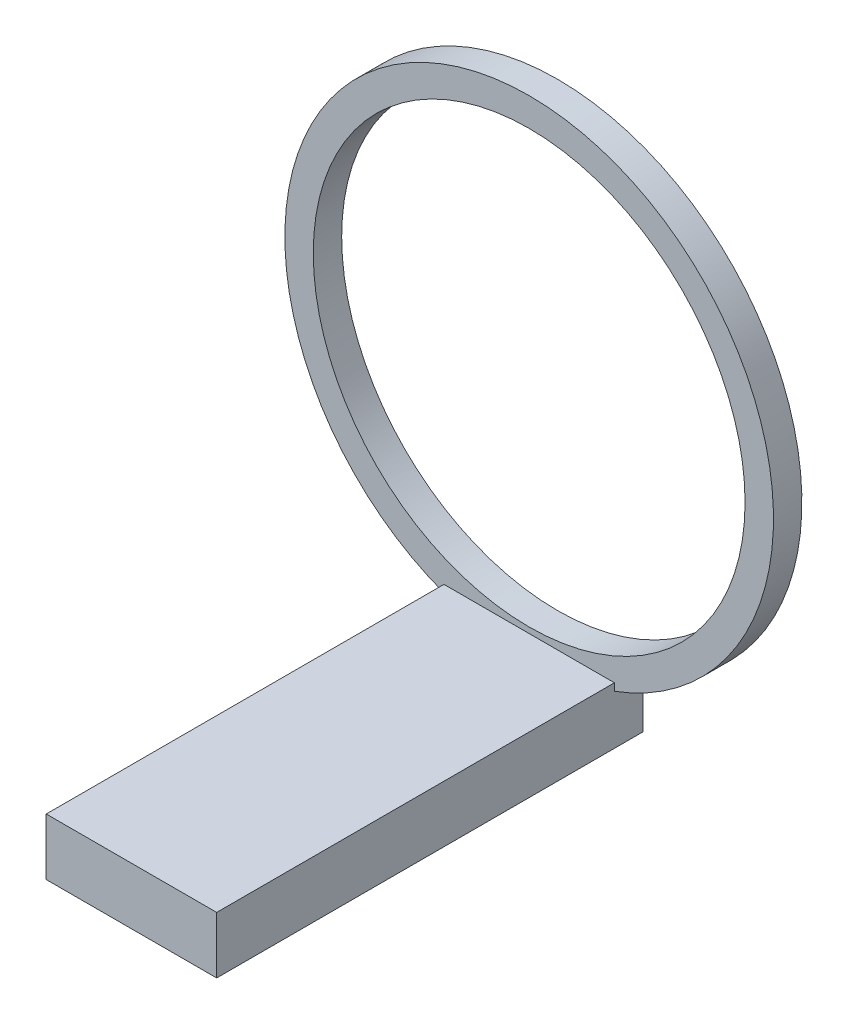
ISO-10303-21;
HEADER;
FILE_DESCRIPTION(('STEP AP214'),'2;1');
FILE_NAME('part.step','',(''),(''),'','','');
FILE_SCHEMA(('AUTOMOTIVE_DESIGN { 1 0 10303 214 1 1 1 1 }'));
ENDSEC;
DATA;
#1=APPLICATION_CONTEXT('core data for automotive mechanical design processes');
#2=APPLICATION_PROTOCOL_DEFINITION('international standard','automotive_design',2000,#1);
#3=PRODUCT_CONTEXT('',#1,'mechanical');
#4=PRODUCT('Part','Part','',(#3));
#5=PRODUCT_RELATED_PRODUCT_CATEGORY('part','',(#4));
#6=PRODUCT_DEFINITION_FORMATION('','',#4);
#7=PRODUCT_DEFINITION_CONTEXT('part definition',#1,'design');
#8=PRODUCT_DEFINITION('design','',#6,#7);
#9=PRODUCT_DEFINITION_SHAPE('','',#8);
#10=(LENGTH_UNIT() NAMED_UNIT(*) SI_UNIT(.MILLI.,.METRE.));
#11=(NAMED_UNIT(*) PLANE_ANGLE_UNIT() SI_UNIT($,.RADIAN.));
#12=(NAMED_UNIT(*) SI_UNIT($,.STERADIAN.) SOLID_ANGLE_UNIT());
#13=UNCERTAINTY_MEASURE_WITH_UNIT(LENGTH_MEASURE(1.E-05),#10,'distance_accuracy_value','');
#14=(GEOMETRIC_REPRESENTATION_CONTEXT(3) GLOBAL_UNCERTAINTY_ASSIGNED_CONTEXT((#13)) GLOBAL_UNIT_ASSIGNED_CONTEXT((#10,
#11,#12)) REPRESENTATION_CONTEXT('',''));
#15=CARTESIAN_POINT('',(0.,0.,0.));
#16=DIRECTION('',(0.,0.,1.));
#17=DIRECTION('',(1.,0.,0.));
#18=AXIS2_PLACEMENT_3D('',#15,#16,#17);
#19=CARTESIAN_POINT('',(-19.05,0.,95.25));
#20=DIRECTION('',(0.,-1.,0.));
#21=DIRECTION('',(1.,0.,0.));
#22=AXIS2_PLACEMENT_3D('',#19,#20,#21);
#23=PLANE('',#22);
#24=DIRECTION('',(1.,0.,0.));
#25=VECTOR('',#24,1.);
#26=CARTESIAN_POINT('',(-19.05,0.,6.34999999999999));
#27=LINE('',#26,#25);
#28=CARTESIAN_POINT('',(-19.05,0.,6.34999999999999));
#29=VERTEX_POINT('',#28);
#30=CARTESIAN_POINT('',(19.05,0.,6.34999999999999));
#31=VERTEX_POINT('',#30);
#32=EDGE_CURVE('E130',#29,#31,#27,.T.);
#33=ORIENTED_EDGE('',*,*,#32,.F.);
#34=DIRECTION('',(0.,0.,-1.));
#35=VECTOR('',#34,1.);
#36=CARTESIAN_POINT('',(-19.05,0.,95.25));
#37=LINE('',#36,#35);
#38=CARTESIAN_POINT('',(-19.05,0.,95.25));
#39=VERTEX_POINT('',#38);
#40=EDGE_CURVE('E148',#39,#29,#37,.T.);
#41=ORIENTED_EDGE('',*,*,#40,.F.);
#42=DIRECTION('',(-1.,0.,0.));
#43=VECTOR('',#42,1.);
#44=CARTESIAN_POINT('',(-19.05,0.,95.25));
#45=LINE('',#44,#43);
#46=CARTESIAN_POINT('',(19.05,0.,95.25));
#47=VERTEX_POINT('',#46);
#48=EDGE_CURVE('E140',#47,#39,#45,.T.);
#49=ORIENTED_EDGE('',*,*,#48,.F.);
#50=DIRECTION('',(0.,0.,-1.));
#51=VECTOR('',#50,1.);
#52=CARTESIAN_POINT('',(19.05,0.,95.25));
#53=LINE('',#52,#51);
#54=EDGE_CURVE('E151',#47,#31,#53,.T.);
#55=ORIENTED_EDGE('',*,*,#54,.T.);
#56=EDGE_LOOP('',(#33,#41,#49,#55));
#57=FACE_BOUND('',#56,.T.);
#58=ADVANCED_FACE('F39',(#57),#23,.F.);
#59=CARTESIAN_POINT('',(-19.05,-12.7,95.25));
#60=DIRECTION('',(0.,1.,0.));
#61=DIRECTION('',(0.,0.,1.));
#62=AXIS2_PLACEMENT_3D('',#59,#60,#61);
#63=PLANE('',#62);
#64=DIRECTION('',(1.,0.,0.));
#65=VECTOR('',#64,1.);
#66=CARTESIAN_POINT('',(-19.05,-12.7,0.));
#67=LINE('',#66,#65);
#68=CARTESIAN_POINT('',(-19.05,-12.7,0.));
#69=VERTEX_POINT('',#68);
#70=CARTESIAN_POINT('',(19.05,-12.7,0.));
#71=VERTEX_POINT('',#70);
#72=EDGE_CURVE('E100',#69,#71,#67,.T.);
#73=ORIENTED_EDGE('',*,*,#72,.T.);
#74=DIRECTION('',(0.,0.,-1.));
#75=VECTOR('',#74,1.);
#76=CARTESIAN_POINT('',(19.05,-12.7,95.25));
#77=LINE('',#76,#75);
#78=CARTESIAN_POINT('',(19.05,-12.7,95.25));
#79=VERTEX_POINT('',#78);
#80=EDGE_CURVE('E47',#79,#71,#77,.T.);
#81=ORIENTED_EDGE('',*,*,#80,.F.);
#82=DIRECTION('',(1.,0.,0.));
#83=VECTOR('',#82,1.);
#84=CARTESIAN_POINT('',(-19.05,-12.7,95.25));
#85=LINE('',#84,#83);
#86=CARTESIAN_POINT('',(-19.05,-12.7,95.25));
#87=VERTEX_POINT('',#86);
#88=EDGE_CURVE('E104',#87,#79,#85,.T.);
#89=ORIENTED_EDGE('',*,*,#88,.F.);
#90=DIRECTION('',(0.,0.,-1.));
#91=VECTOR('',#90,1.);
#92=CARTESIAN_POINT('',(-19.05,-12.7,95.25));
#93=LINE('',#92,#91);
#94=EDGE_CURVE('E144',#87,#69,#93,.T.);
#95=ORIENTED_EDGE('',*,*,#94,.T.);
#96=EDGE_LOOP('',(#73,#81,#89,#95));
#97=FACE_BOUND('',#96,.T.);
#98=ADVANCED_FACE('F41',(#97),#63,.F.);
#99=CARTESIAN_POINT('',(19.05,-12.7,95.25));
#100=DIRECTION('',(-1.,0.,0.));
#101=DIRECTION('',(0.,0.,1.));
#102=AXIS2_PLACEMENT_3D('',#99,#100,#101);
#103=PLANE('',#102);
#104=DIRECTION('',(0.,1.,0.));
#105=VECTOR('',#104,1.);
#106=CARTESIAN_POINT('',(19.05,-12.7,0.));
#107=LINE('',#106,#105);
#108=CARTESIAN_POINT('',(19.05,-1.64958186620911,0.));
#109=VERTEX_POINT('',#108);
#110=EDGE_CURVE('E105',#71,#109,#107,.T.);
#111=ORIENTED_EDGE('',*,*,#110,.T.);
#112=DIRECTION('',(0.,0.,-1.));
#113=VECTOR('',#112,1.);
#114=CARTESIAN_POINT('',(19.05,-1.64958186620911,6.35));
#115=LINE('',#114,#113);
#116=CARTESIAN_POINT('',(19.05,-1.64958186620911,6.35));
#117=VERTEX_POINT('',#116);
#118=EDGE_CURVE('E56',#109,#117,#115,.F.);
#119=ORIENTED_EDGE('',*,*,#118,.T.);
#120=DIRECTION('',(0.,-1.,0.));
#121=VECTOR('',#120,1.);
#122=CARTESIAN_POINT('',(19.05,-12.7,6.34999999999999));
#123=LINE('',#122,#121);
#124=EDGE_CURVE('E60',#31,#117,#123,.T.);
#125=ORIENTED_EDGE('',*,*,#124,.F.);
#126=ORIENTED_EDGE('',*,*,#54,.F.);
#127=DIRECTION('',(0.,1.,0.));
#128=VECTOR('',#127,1.);
#129=CARTESIAN_POINT('',(19.05,-12.7,95.25));
#130=LINE('',#129,#128);
#131=EDGE_CURVE('E138',#79,#47,#130,.T.);
#132=ORIENTED_EDGE('',*,*,#131,.F.);
#133=ORIENTED_EDGE('',*,*,#80,.T.);
#134=EDGE_LOOP('',(#111,#119,#125,#126,#132,#133));
#135=FACE_BOUND('',#134,.T.);
#136=ADVANCED_FACE('F155',(#135),#103,.F.);
#137=CARTESIAN_POINT('',(-19.05,-12.7,95.25));
#138=DIRECTION('',(1.,0.,0.));
#139=DIRECTION('',(0.,0.,-1.));
#140=AXIS2_PLACEMENT_3D('',#137,#138,#139);
#141=PLANE('',#140);
#142=DIRECTION('',(0.,1.,0.));
#143=VECTOR('',#142,1.);
#144=CARTESIAN_POINT('',(-19.05,-12.7,6.34999999999999));
#145=LINE('',#144,#143);
#146=CARTESIAN_POINT('',(-19.05,-1.64958186620911,6.35));
#147=VERTEX_POINT('',#146);
#148=EDGE_CURVE('E11',#147,#29,#145,.T.);
#149=ORIENTED_EDGE('',*,*,#148,.F.);
#150=DIRECTION('',(0.,0.,-1.));
#151=VECTOR('',#150,1.);
#152=CARTESIAN_POINT('',(-19.05,-1.64958186620911,6.35));
#153=LINE('',#152,#151);
#154=CARTESIAN_POINT('',(-19.05,-1.64958186620912,0.));
#155=VERTEX_POINT('',#154);
#156=EDGE_CURVE('E108',#147,#155,#153,.T.);
#157=ORIENTED_EDGE('',*,*,#156,.T.);
#158=DIRECTION('',(0.,-1.,0.));
#159=VECTOR('',#158,1.);
#160=CARTESIAN_POINT('',(-19.05,-12.7,0.));
#161=LINE('',#160,#159);
#162=EDGE_CURVE('E93',#155,#69,#161,.T.);
#163=ORIENTED_EDGE('',*,*,#162,.T.);
#164=ORIENTED_EDGE('',*,*,#94,.F.);
#165=DIRECTION('',(0.,-1.,0.));
#166=VECTOR('',#165,1.);
#167=CARTESIAN_POINT('',(-19.05,-12.7,95.25));
#168=LINE('',#167,#166);
#169=EDGE_CURVE('E142',#39,#87,#168,.T.);
#170=ORIENTED_EDGE('',*,*,#169,.F.);
#171=ORIENTED_EDGE('',*,*,#40,.T.);
#172=EDGE_LOOP('',(#149,#157,#163,#164,#170,#171));
#173=FACE_BOUND('',#172,.T.);
#174=ADVANCED_FACE('F109',(#173),#141,.F.);
#175=CARTESIAN_POINT('',(0.,0.,95.25));
#176=DIRECTION('',(0.,0.,1.));
#177=DIRECTION('',(1.,0.,0.));
#178=AXIS2_PLACEMENT_3D('',#175,#176,#177);
#179=PLANE('',#178);
#180=ORIENTED_EDGE('',*,*,#88,.T.);
#181=ORIENTED_EDGE('',*,*,#131,.T.);
#182=ORIENTED_EDGE('',*,*,#48,.T.);
#183=ORIENTED_EDGE('',*,*,#169,.T.);
#184=EDGE_LOOP('',(#180,#181,#182,#183));
#185=FACE_BOUND('',#184,.T.);
#186=ADVANCED_FACE('F161',(#185),#179,.T.);
#187=CARTESIAN_POINT('',(0.,0.,0.));
#188=DIRECTION('',(0.,0.,1.));
#189=DIRECTION('',(1.,0.,0.));
#190=AXIS2_PLACEMENT_3D('',#187,#188,#189);
#191=PLANE('',#190);
#192=ORIENTED_EDGE('',*,*,#162,.F.);
#193=CARTESIAN_POINT('',(0.,49.53,0.));
#194=DIRECTION('',(0.,0.,-1.));
#195=DIRECTION('',(-1.,0.,0.));
#196=AXIS2_PLACEMENT_3D('',#193,#194,#195);
#197=CIRCLE('',#196,54.61);
#198=EDGE_CURVE('E98',#155,#109,#197,.T.);
#199=ORIENTED_EDGE('',*,*,#198,.T.);
#200=ORIENTED_EDGE('',*,*,#110,.F.);
#201=ORIENTED_EDGE('',*,*,#72,.F.);
#202=EDGE_LOOP('',(#192,#199,#200,#201));
#203=FACE_BOUND('',#202,.T.);
#204=CARTESIAN_POINT('',(0.,49.53,0.));
#205=DIRECTION('',(0.,0.,-1.));
#206=DIRECTION('',(-1.,0.,0.));
#207=AXIS2_PLACEMENT_3D('',#204,#205,#206);
#208=CIRCLE('',#207,48.26);
#209=CARTESIAN_POINT('',(-48.26,49.53,0.));
#210=VERTEX_POINT('',#209);
#211=EDGE_CURVE('E124',#210,#210,#208,.T.);
#212=ORIENTED_EDGE('',*,*,#211,.F.);
#213=EDGE_LOOP('',(#212));
#214=FACE_BOUND('',#213,.T.);
#215=ADVANCED_FACE('F95',(#203,#214),#191,.F.);
#216=CARTESIAN_POINT('',(0.,49.53,6.35));
#217=DIRECTION('',(0.,0.,-1.));
#218=DIRECTION('',(-1.,0.,0.));
#219=AXIS2_PLACEMENT_3D('',#216,#217,#218);
#220=PLANE('',#219);
#221=CARTESIAN_POINT('',(0.,49.53,6.35));
#222=DIRECTION('',(0.,0.,-1.));
#223=DIRECTION('',(-1.,0.,0.));
#224=AXIS2_PLACEMENT_3D('',#221,#222,#223);
#225=CIRCLE('',#224,48.26);
#226=CARTESIAN_POINT('',(-48.26,49.53,6.35));
#227=VERTEX_POINT('',#226);
#228=EDGE_CURVE('E118',#227,#227,#225,.T.);
#229=ORIENTED_EDGE('',*,*,#228,.T.);
#230=EDGE_LOOP('',(#229));
#231=FACE_BOUND('',#230,.T.);
#232=ORIENTED_EDGE('',*,*,#32,.T.);
#233=ORIENTED_EDGE('',*,*,#124,.T.);
#234=CARTESIAN_POINT('',(0.,49.53,6.35));
#235=DIRECTION('',(0.,0.,-1.));
#236=DIRECTION('',(-1.,0.,0.));
#237=AXIS2_PLACEMENT_3D('',#234,#235,#236);
#238=CIRCLE('',#237,54.61);
#239=EDGE_CURVE('E114',#147,#117,#238,.T.);
#240=ORIENTED_EDGE('',*,*,#239,.F.);
#241=ORIENTED_EDGE('',*,*,#148,.T.);
#242=EDGE_LOOP('',(#232,#233,#240,#241));
#243=FACE_BOUND('',#242,.T.);
#244=ADVANCED_FACE('F165',(#231,#243),#220,.F.);
#245=CARTESIAN_POINT('',(0.,49.53,6.35));
#246=DIRECTION('',(0.,0.,-1.));
#247=DIRECTION('',(-1.,0.,0.));
#248=AXIS2_PLACEMENT_3D('',#245,#246,#247);
#249=CYLINDRICAL_SURFACE('',#248,54.61);
#250=ORIENTED_EDGE('',*,*,#118,.F.);
#251=ORIENTED_EDGE('',*,*,#198,.F.);
#252=ORIENTED_EDGE('',*,*,#156,.F.);
#253=ORIENTED_EDGE('',*,*,#239,.T.);
#254=EDGE_LOOP('',(#250,#251,#252,#253));
#255=FACE_BOUND('',#254,.T.);
#256=ADVANCED_FACE('F116',(#255),#249,.T.);
#257=CARTESIAN_POINT('',(0.,49.53,6.35));
#258=DIRECTION('',(0.,0.,-1.));
#259=DIRECTION('',(-1.,0.,0.));
#260=AXIS2_PLACEMENT_3D('',#257,#258,#259);
#261=CYLINDRICAL_SURFACE('',#260,48.26);
#262=ORIENTED_EDGE('',*,*,#228,.F.);
#263=EDGE_LOOP('',(#262));
#264=FACE_BOUND('',#263,.T.);
#265=ORIENTED_EDGE('',*,*,#211,.T.);
#266=EDGE_LOOP('',(#265));
#267=FACE_BOUND('',#266,.T.);
#268=ADVANCED_FACE('F173',(#264,#267),#261,.F.);
#269=CLOSED_SHELL('',(#58,#98,#136,#174,#186,#215,#244,#256,#268));
#270=MANIFOLD_SOLID_BREP('B2',#269);
#271=ADVANCED_BREP_SHAPE_REPRESENTATION('',(#18,#270),#14);
#272=SHAPE_DEFINITION_REPRESENTATION(#9,#271);
ENDSEC;
END-ISO-10303-21;
